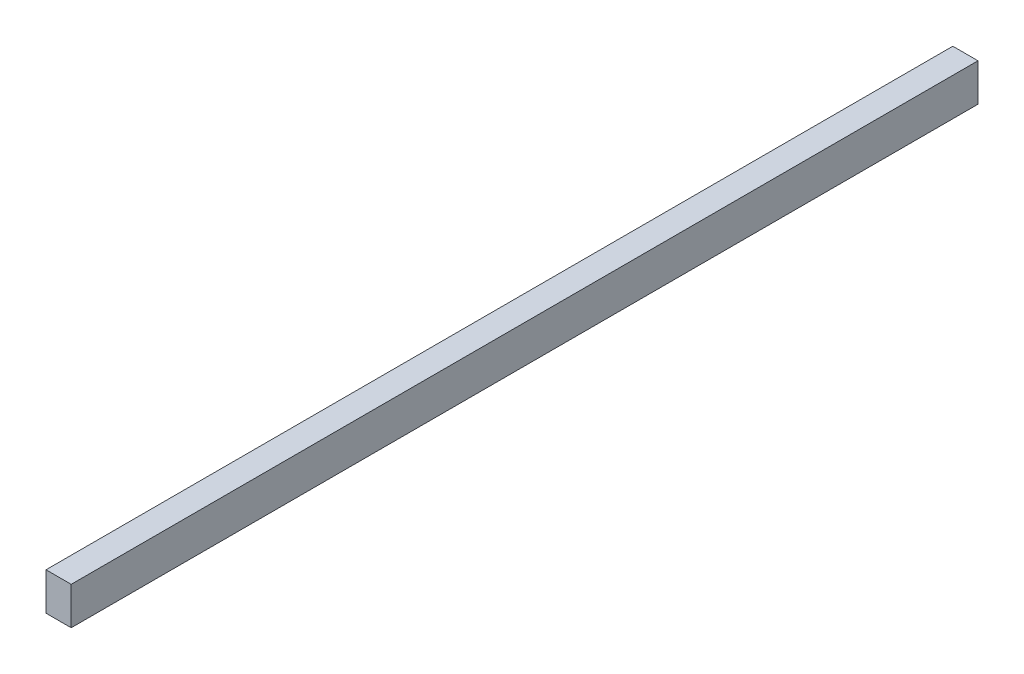
ISO-10303-21;
HEADER;
FILE_DESCRIPTION(('STEP AP214'),'2;1');
FILE_NAME('part.step','',(''),(''),'','','');
FILE_SCHEMA(('AUTOMOTIVE_DESIGN { 1 0 10303 214 1 1 1 1 }'));
ENDSEC;
DATA;
#1=APPLICATION_CONTEXT('core data for automotive mechanical design processes');
#2=APPLICATION_PROTOCOL_DEFINITION('international standard','automotive_design',2000,#1);
#3=PRODUCT_CONTEXT('',#1,'mechanical');
#4=PRODUCT('Part','Part','',(#3));
#5=PRODUCT_RELATED_PRODUCT_CATEGORY('part','',(#4));
#6=PRODUCT_DEFINITION_FORMATION('','',#4);
#7=PRODUCT_DEFINITION_CONTEXT('part definition',#1,'design');
#8=PRODUCT_DEFINITION('design','',#6,#7);
#9=PRODUCT_DEFINITION_SHAPE('','',#8);
#10=(LENGTH_UNIT() NAMED_UNIT(*) SI_UNIT(.MILLI.,.METRE.));
#11=(NAMED_UNIT(*) PLANE_ANGLE_UNIT() SI_UNIT($,.RADIAN.));
#12=(NAMED_UNIT(*) SI_UNIT($,.STERADIAN.) SOLID_ANGLE_UNIT());
#13=UNCERTAINTY_MEASURE_WITH_UNIT(LENGTH_MEASURE(1.E-05),#10,'distance_accuracy_value','');
#14=(GEOMETRIC_REPRESENTATION_CONTEXT(3) GLOBAL_UNCERTAINTY_ASSIGNED_CONTEXT((#13)) GLOBAL_UNIT_ASSIGNED_CONTEXT((#10,
#11,#12)) REPRESENTATION_CONTEXT('',''));
#15=CARTESIAN_POINT('',(0.,0.,0.));
#16=DIRECTION('',(0.,0.,1.));
#17=DIRECTION('',(1.,0.,0.));
#18=AXIS2_PLACEMENT_3D('',#15,#16,#17);
#19=CARTESIAN_POINT('',(212.959555583976,-148.537700895744,284.7119670539));
#20=DIRECTION('',(1.,0.,0.));
#21=DIRECTION('',(0.,1.,0.));
#22=AXIS2_PLACEMENT_3D('',#19,#20,#21);
#23=PLANE('',#22);
#24=DIRECTION('',(0.,0.,1.));
#25=VECTOR('',#24,1.);
#26=CARTESIAN_POINT('',(212.959555583976,-149.045793579175,284.7119670539));
#27=LINE('',#26,#25);
#28=CARTESIAN_POINT('',(212.959555583976,-149.045793579175,284.7119670539));
#29=VERTEX_POINT('',#28);
#30=CARTESIAN_POINT('',(212.959555583976,-149.045793579175,296.951975387089));
#31=VERTEX_POINT('',#30);
#32=EDGE_CURVE('E79',#29,#31,#27,.T.);
#33=ORIENTED_EDGE('',*,*,#32,.F.);
#34=DIRECTION('',(0.,-1.,0.));
#35=VECTOR('',#34,1.);
#36=CARTESIAN_POINT('',(212.959555583976,-148.537700895744,284.7119670539));
#37=LINE('',#36,#35);
#38=CARTESIAN_POINT('',(212.959555583976,-148.537700895744,284.7119670539));
#39=VERTEX_POINT('',#38);
#40=EDGE_CURVE('E32',#39,#29,#37,.T.);
#41=ORIENTED_EDGE('',*,*,#40,.F.);
#42=DIRECTION('',(0.,0.,1.));
#43=VECTOR('',#42,1.);
#44=CARTESIAN_POINT('',(212.959555583976,-148.537700895744,284.7119670539));
#45=LINE('',#44,#43);
#46=CARTESIAN_POINT('',(212.959555583976,-148.537700895744,296.951975387089));
#47=VERTEX_POINT('',#46);
#48=EDGE_CURVE('E71',#39,#47,#45,.T.);
#49=ORIENTED_EDGE('',*,*,#48,.T.);
#50=DIRECTION('',(0.,-1.,0.));
#51=VECTOR('',#50,1.);
#52=CARTESIAN_POINT('',(212.959555583976,-148.537700895744,296.951975387089));
#53=LINE('',#52,#51);
#54=EDGE_CURVE('E10',#47,#31,#53,.T.);
#55=ORIENTED_EDGE('',*,*,#54,.T.);
#56=EDGE_LOOP('',(#33,#41,#49,#55));
#57=FACE_BOUND('',#56,.T.);
#58=ADVANCED_FACE('F16',(#57),#23,.T.);
#59=CARTESIAN_POINT('',(212.959555583976,-148.537700895744,296.951975387089));
#60=DIRECTION('',(0.,0.,1.));
#61=DIRECTION('',(1.,0.,0.));
#62=AXIS2_PLACEMENT_3D('',#59,#60,#61);
#63=PLANE('',#62);
#64=DIRECTION('',(-1.,0.,0.));
#65=VECTOR('',#64,1.);
#66=CARTESIAN_POINT('',(212.959555583976,-149.045793579175,296.951975387089));
#67=LINE('',#66,#65);
#68=CARTESIAN_POINT('',(212.619547250787,-149.045793579175,296.951975387089));
#69=VERTEX_POINT('',#68);
#70=EDGE_CURVE('E82',#31,#69,#67,.T.);
#71=ORIENTED_EDGE('',*,*,#70,.F.);
#72=ORIENTED_EDGE('',*,*,#54,.F.);
#73=DIRECTION('',(-1.,0.,0.));
#74=VECTOR('',#73,1.);
#75=CARTESIAN_POINT('',(212.959555583976,-148.537700895744,296.951975387089));
#76=LINE('',#75,#74);
#77=CARTESIAN_POINT('',(212.619547250787,-148.537700895744,296.951975387089));
#78=VERTEX_POINT('',#77);
#79=EDGE_CURVE('E67',#47,#78,#76,.T.);
#80=ORIENTED_EDGE('',*,*,#79,.T.);
#81=DIRECTION('',(0.,-1.,0.));
#82=VECTOR('',#81,1.);
#83=CARTESIAN_POINT('',(212.619547250787,-148.537700895744,296.951975387089));
#84=LINE('',#83,#82);
#85=EDGE_CURVE('E24',#78,#69,#84,.T.);
#86=ORIENTED_EDGE('',*,*,#85,.T.);
#87=EDGE_LOOP('',(#71,#72,#80,#86));
#88=FACE_BOUND('',#87,.T.);
#89=ADVANCED_FACE('F68',(#88),#63,.T.);
#90=CARTESIAN_POINT('',(212.619547250787,-148.537700895744,296.951975387089));
#91=DIRECTION('',(-1.,0.,0.));
#92=DIRECTION('',(0.,-1.,0.));
#93=AXIS2_PLACEMENT_3D('',#90,#91,#92);
#94=PLANE('',#93);
#95=DIRECTION('',(0.,0.,-1.));
#96=VECTOR('',#95,1.);
#97=CARTESIAN_POINT('',(212.619547250787,-149.045793579175,296.951975387089));
#98=LINE('',#97,#96);
#99=CARTESIAN_POINT('',(212.619547250787,-149.045793579175,284.7119670539));
#100=VERTEX_POINT('',#99);
#101=EDGE_CURVE('E65',#69,#100,#98,.T.);
#102=ORIENTED_EDGE('',*,*,#101,.F.);
#103=ORIENTED_EDGE('',*,*,#85,.F.);
#104=DIRECTION('',(0.,0.,-1.));
#105=VECTOR('',#104,1.);
#106=CARTESIAN_POINT('',(212.619547250787,-148.537700895744,296.951975387089));
#107=LINE('',#106,#105);
#108=CARTESIAN_POINT('',(212.619547250787,-148.537700895744,284.7119670539));
#109=VERTEX_POINT('',#108);
#110=EDGE_CURVE('E62',#78,#109,#107,.T.);
#111=ORIENTED_EDGE('',*,*,#110,.T.);
#112=DIRECTION('',(0.,-1.,0.));
#113=VECTOR('',#112,1.);
#114=CARTESIAN_POINT('',(212.619547250787,-148.537700895744,284.7119670539));
#115=LINE('',#114,#113);
#116=EDGE_CURVE('E48',#109,#100,#115,.T.);
#117=ORIENTED_EDGE('',*,*,#116,.T.);
#118=EDGE_LOOP('',(#102,#103,#111,#117));
#119=FACE_BOUND('',#118,.T.);
#120=ADVANCED_FACE('F60',(#119),#94,.T.);
#121=CARTESIAN_POINT('',(212.619547250787,-148.537700895744,284.7119670539));
#122=DIRECTION('',(0.,0.,-1.));
#123=DIRECTION('',(-1.,0.,0.));
#124=AXIS2_PLACEMENT_3D('',#121,#122,#123);
#125=PLANE('',#124);
#126=DIRECTION('',(1.,0.,0.));
#127=VECTOR('',#126,1.);
#128=CARTESIAN_POINT('',(212.619547250787,-149.045793579175,284.7119670539));
#129=LINE('',#128,#127);
#130=EDGE_CURVE('E85',#100,#29,#129,.T.);
#131=ORIENTED_EDGE('',*,*,#130,.F.);
#132=ORIENTED_EDGE('',*,*,#116,.F.);
#133=DIRECTION('',(1.,0.,0.));
#134=VECTOR('',#133,1.);
#135=CARTESIAN_POINT('',(212.619547250787,-148.537700895744,284.7119670539));
#136=LINE('',#135,#134);
#137=EDGE_CURVE('E74',#109,#39,#136,.T.);
#138=ORIENTED_EDGE('',*,*,#137,.T.);
#139=ORIENTED_EDGE('',*,*,#40,.T.);
#140=EDGE_LOOP('',(#131,#132,#138,#139));
#141=FACE_BOUND('',#140,.T.);
#142=ADVANCED_FACE('F96',(#141),#125,.T.);
#143=CARTESIAN_POINT('',(206.339551417382,-148.537700895744,290.831971220494));
#144=DIRECTION('',(0.,-1.,0.));
#145=DIRECTION('',(1.,0.,0.));
#146=AXIS2_PLACEMENT_3D('',#143,#144,#145);
#147=PLANE('',#146);
#148=ORIENTED_EDGE('',*,*,#48,.F.);
#149=ORIENTED_EDGE('',*,*,#137,.F.);
#150=ORIENTED_EDGE('',*,*,#110,.F.);
#151=ORIENTED_EDGE('',*,*,#79,.F.);
#152=EDGE_LOOP('',(#148,#149,#150,#151));
#153=FACE_BOUND('',#152,.T.);
#154=ADVANCED_FACE('F73',(#153),#147,.F.);
#155=CARTESIAN_POINT('',(206.339551417382,-149.045793579175,290.831971220494));
#156=DIRECTION('',(0.,-1.,0.));
#157=DIRECTION('',(1.,0.,0.));
#158=AXIS2_PLACEMENT_3D('',#155,#156,#157);
#159=PLANE('',#158);
#160=ORIENTED_EDGE('',*,*,#32,.T.);
#161=ORIENTED_EDGE('',*,*,#70,.T.);
#162=ORIENTED_EDGE('',*,*,#101,.T.);
#163=ORIENTED_EDGE('',*,*,#130,.T.);
#164=EDGE_LOOP('',(#160,#161,#162,#163));
#165=FACE_BOUND('',#164,.T.);
#166=ADVANCED_FACE('F89',(#165),#159,.T.);
#167=CLOSED_SHELL('',(#58,#89,#120,#142,#154,#166));
#168=MANIFOLD_SOLID_BREP('B1',#167);
#169=ADVANCED_BREP_SHAPE_REPRESENTATION('',(#18,#168),#14);
#170=SHAPE_DEFINITION_REPRESENTATION(#9,#169);
ENDSEC;
END-ISO-10303-21;
